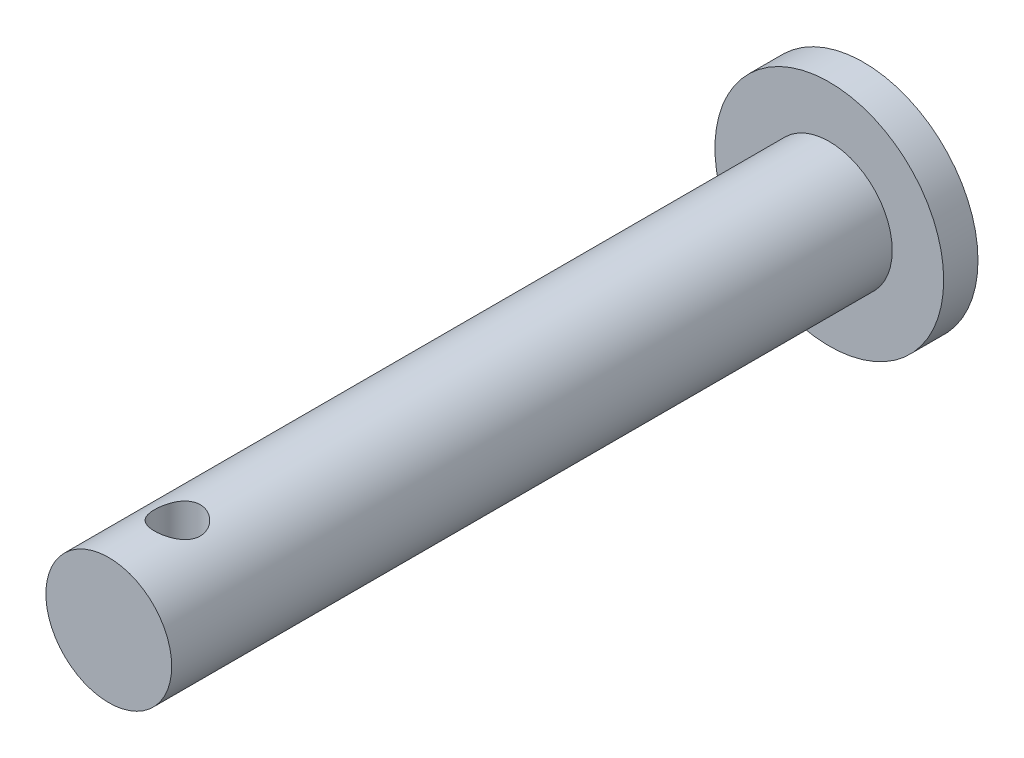
ISO-10303-21;
HEADER;
FILE_DESCRIPTION(('STEP AP214'),'2;1');
FILE_NAME('part.step','',(''),(''),'','','');
FILE_SCHEMA(('AUTOMOTIVE_DESIGN { 1 0 10303 214 1 1 1 1 }'));
ENDSEC;
DATA;
#1=APPLICATION_CONTEXT('core data for automotive mechanical design processes');
#2=APPLICATION_PROTOCOL_DEFINITION('international standard','automotive_design',2000,#1);
#3=PRODUCT_CONTEXT('',#1,'mechanical');
#4=PRODUCT('Part','Part','',(#3));
#5=PRODUCT_RELATED_PRODUCT_CATEGORY('part','',(#4));
#6=PRODUCT_DEFINITION_FORMATION('','',#4);
#7=PRODUCT_DEFINITION_CONTEXT('part definition',#1,'design');
#8=PRODUCT_DEFINITION('design','',#6,#7);
#9=PRODUCT_DEFINITION_SHAPE('','',#8);
#10=(LENGTH_UNIT() NAMED_UNIT(*) SI_UNIT(.MILLI.,.METRE.));
#11=(NAMED_UNIT(*) PLANE_ANGLE_UNIT() SI_UNIT($,.RADIAN.));
#12=(NAMED_UNIT(*) SI_UNIT($,.STERADIAN.) SOLID_ANGLE_UNIT());
#13=UNCERTAINTY_MEASURE_WITH_UNIT(LENGTH_MEASURE(1.E-05),#10,'distance_accuracy_value','');
#14=(GEOMETRIC_REPRESENTATION_CONTEXT(3) GLOBAL_UNCERTAINTY_ASSIGNED_CONTEXT((#13)) GLOBAL_UNIT_ASSIGNED_CONTEXT((#10,
#11,#12)) REPRESENTATION_CONTEXT('',''));
#15=CARTESIAN_POINT('',(0.,0.,0.));
#16=DIRECTION('',(0.,0.,1.));
#17=DIRECTION('',(1.,0.,0.));
#18=AXIS2_PLACEMENT_3D('',#15,#16,#17);
#19=CARTESIAN_POINT('',(0.,0.,33.));
#20=DIRECTION('',(0.,0.,-1.));
#21=DIRECTION('',(-1.,0.,0.));
#22=AXIS2_PLACEMENT_3D('',#19,#20,#21);
#23=CYLINDRICAL_SURFACE('',#22,2.75);
#24=CARTESIAN_POINT('',(0.,0.,1.5));
#25=DIRECTION('',(0.,0.,1.));
#26=DIRECTION('',(1.,0.,0.));
#27=AXIS2_PLACEMENT_3D('',#24,#25,#26);
#28=CIRCLE('',#27,2.75);
#29=CARTESIAN_POINT('',(2.75,0.,1.5));
#30=VERTEX_POINT('',#29);
#31=EDGE_CURVE('E61',#30,#30,#28,.F.);
#32=ORIENTED_EDGE('',*,*,#31,.F.);
#33=EDGE_LOOP('',(#32));
#34=FACE_BOUND('',#33,.T.);
#35=CARTESIAN_POINT('',(0.,0.,33.));
#36=DIRECTION('',(0.,0.,1.));
#37=DIRECTION('',(1.,0.,0.));
#38=AXIS2_PLACEMENT_3D('',#35,#36,#37);
#39=CIRCLE('',#38,2.75);
#40=CARTESIAN_POINT('',(2.75,0.,33.));
#41=VERTEX_POINT('',#40);
#42=EDGE_CURVE('E66',#41,#41,#39,.T.);
#43=ORIENTED_EDGE('',*,*,#42,.F.);
#44=EDGE_LOOP('',(#43));
#45=FACE_BOUND('',#44,.T.);
#46=CARTESIAN_POINT('',(0.,2.75,29.));
#47=CARTESIAN_POINT('',(-0.05427158361245,2.75000102828592,28.999998593537));
#48=CARTESIAN_POINT('',(-0.108533268023079,2.74837919091224,29.0044320973729));
#49=CARTESIAN_POINT('',(-0.21544139666163,2.74207073754075,29.0219822275839));
#50=CARTESIAN_POINT('',(-0.268087964675667,2.73738435703378,29.0350981867679));
#51=CARTESIAN_POINT('',(-0.370208982732222,2.72545162836973,29.0694923559232));
#52=CARTESIAN_POINT('',(-0.419689127060851,2.71821003742993,29.090755404154));
#53=CARTESIAN_POINT('',(-0.514378106430631,2.7018931355003,29.140765474057));
#54=CARTESIAN_POINT('',(-0.559585868286279,2.69281736556791,29.169514369335));
#55=CARTESIAN_POINT('',(-0.64626847495417,2.67336544251623,29.2348919915928));
#56=CARTESIAN_POINT('',(-0.687548063931848,2.66295402798401,29.2717690238565));
#57=CARTESIAN_POINT('',(-0.763491995807494,2.64218336390661,29.3518288743995));
#58=CARTESIAN_POINT('',(-0.798154485530761,2.63182412976351,29.3950134532013));
#59=CARTESIAN_POINT('',(-0.861085204825156,2.61192692799095,29.488327524755));
#60=CARTESIAN_POINT('',(-0.889083899715415,2.60243096933403,29.5386486360943));
#61=CARTESIAN_POINT('',(-0.936134697200381,2.58588061286966,29.6436857380148));
#62=CARTESIAN_POINT('',(-0.955190130970065,2.57882530622898,29.6984000833024));
#63=CARTESIAN_POINT('',(-0.983053381727302,2.56833043749789,29.8084293283742));
#64=CARTESIAN_POINT('',(-0.992232085048729,2.56476051810849,29.8636374678461));
#65=CARTESIAN_POINT('',(-1.00124109076666,2.56125788758604,29.974916877885));
#66=CARTESIAN_POINT('',(-1.00107496394965,2.56132378715702,30.0309878105793));
#67=CARTESIAN_POINT('',(-0.991683838835923,2.56497242531705,30.1390761012675));
#68=CARTESIAN_POINT('',(-0.982964271111847,2.56835894106269,30.1911452026176));
#69=CARTESIAN_POINT('',(-0.957546210263846,2.57794255403146,30.2930232308437));
#70=CARTESIAN_POINT('',(-0.940846587774043,2.58414004906813,30.3428318367135));
#71=CARTESIAN_POINT('',(-0.899650242741095,2.59877143656644,30.4398381812909));
#72=CARTESIAN_POINT('',(-0.875017252502512,2.60724394841139,30.4869719700226));
#73=CARTESIAN_POINT('',(-0.818748232812838,2.62545692968767,30.576587375774));
#74=CARTESIAN_POINT('',(-0.787109890287113,2.63519781748133,30.6190674492575));
#75=CARTESIAN_POINT('',(-0.715383379718291,2.65559784978113,30.7009798547523));
#76=CARTESIAN_POINT('',(-0.674888914115522,2.66627621521456,30.7400524569347));
#77=CARTESIAN_POINT('',(-0.587796439132978,2.6868187492034,30.8109555052473));
#78=CARTESIAN_POINT('',(-0.541197601732014,2.69668280700646,30.8427849672831));
#79=CARTESIAN_POINT('',(-0.442345741239071,2.71466109847137,30.8986635812457));
#80=CARTESIAN_POINT('',(-0.390023720211993,2.72274937801428,30.9225996114695));
#81=CARTESIAN_POINT('',(-0.281728959561495,2.73607360346721,30.9612125713083));
#82=CARTESIAN_POINT('',(-0.225757751375339,2.74131073738571,30.9758933577795));
#83=CARTESIAN_POINT('',(-0.114786083676351,2.74813714481768,30.994903006537));
#84=CARTESIAN_POINT('',(-0.0598790944675641,2.74989711432767,30.9997167322465));
#85=CARTESIAN_POINT('',(0.0499795667814049,2.75009397659377,31.0002587675893));
#86=CARTESIAN_POINT('',(0.104931227273108,2.74853155450921,30.9959889504739));
#87=CARTESIAN_POINT('',(0.211268130365439,2.74237196117977,30.978858296792));
#88=CARTESIAN_POINT('',(0.262710667294036,2.73788504615824,30.9663093876705));
#89=CARTESIAN_POINT('',(0.362728585048041,2.72643794415668,30.9333815719173));
#90=CARTESIAN_POINT('',(0.411303592012264,2.71947743550269,30.9130016468875));
#91=CARTESIAN_POINT('',(0.505765388196055,2.70352785875039,30.8643522216297));
#92=CARTESIAN_POINT('',(0.551535216679312,2.69448636437226,30.8358733251328));
#93=CARTESIAN_POINT('',(0.637795338528293,2.67538261287497,30.7720734500662));
#94=CARTESIAN_POINT('',(0.678283760636928,2.6653199961946,30.7367500573786));
#95=CARTESIAN_POINT('',(0.755135775069413,2.64460590178417,30.6579961059249));
#96=CARTESIAN_POINT('',(0.791154493963307,2.63395220828256,30.6142287209364));
#97=CARTESIAN_POINT('',(0.855397050762111,2.61379664346752,30.5210545082738));
#98=CARTESIAN_POINT('',(0.883620400746443,2.60429484427327,30.4716473278721));
#99=CARTESIAN_POINT('',(0.931445925955383,2.5875770963738,30.368313526383));
#100=CARTESIAN_POINT('',(0.951029808644722,2.58036600678337,30.3143776009791));
#101=CARTESIAN_POINT('',(0.980719773373589,2.56923043824549,30.2036412760543));
#102=CARTESIAN_POINT('',(0.990831247611735,2.56530408958517,30.1468425256363));
#103=CARTESIAN_POINT('',(1.0008235052886,2.56142114085343,30.0357043459204));
#104=CARTESIAN_POINT('',(1.0012878449391,2.56123811777665,29.9814248161302));
#105=CARTESIAN_POINT('',(0.993451162726875,2.56428783487999,29.8736052166234));
#106=CARTESIAN_POINT('',(0.985150873770355,2.56752028945478,29.8200650854568));
#107=CARTESIAN_POINT('',(0.960464129671408,2.57685358798143,29.7167025221326));
#108=CARTESIAN_POINT('',(0.944301768141366,2.58287473014433,29.6668187704012));
#109=CARTESIAN_POINT('',(0.904542113040586,2.59706506711978,29.570438609955));
#110=CARTESIAN_POINT('',(0.880942996186518,2.60523478862223,29.5239430353716));
#111=CARTESIAN_POINT('',(0.8256057397389,2.62331120262658,29.4331292729));
#112=CARTESIAN_POINT('',(0.793519132090325,2.63328440127836,29.3890368019077));
#113=CARTESIAN_POINT('',(0.722670862434718,2.65360200752593,29.3066749241607));
#114=CARTESIAN_POINT('',(0.683907144647625,2.66394652866745,29.268407317648));
#115=CARTESIAN_POINT('',(0.598501849490864,2.68445803074377,29.1968502668555));
#116=CARTESIAN_POINT('',(0.551564727014747,2.69459070625497,29.1639022500985));
#117=CARTESIAN_POINT('',(0.452467923935937,2.7129890144715,29.1063814622141));
#118=CARTESIAN_POINT('',(0.400308357228825,2.72125468788124,29.0818085084876));
#119=CARTESIAN_POINT('',(0.291211408351316,2.73509951863932,29.0415451660636));
#120=CARTESIAN_POINT('',(0.234204430246389,2.74062712951142,29.0260242980112));
#121=CARTESIAN_POINT('',(0.118127131621766,2.74807603940632,29.0052546772001));
#122=CARTESIAN_POINT('',(0.0590577047217948,2.74999888103125,29.0000015304967));
#123=CARTESIAN_POINT('',(0.,2.75,29.));
#124=B_SPLINE_CURVE_WITH_KNOTS('',3,(#46,#47,#48,#49,#50,#51,#52,#53,#54,#55,#56,#57,#58,#59,
#60,#61,#62,#63,#64,#65,#66,#67,#68,#69,#70,#71,#72,#73,#74,#75,#76,#77,#78,#79,#80,#81,#82,#83,
#84,#85,#86,#87,#88,#89,#90,#91,#92,#93,#94,#95,#96,#97,#98,#99,#100,#101,#102,#103,#104,#105,
#106,#107,#108,#109,#110,#111,#112,#113,#114,#115,#116,#117,#118,#119,#120,#121,#122,#123),
.UNSPECIFIED.,.T.,.F.,(4,2,2,2,2,2,2,2,2,2,2,2,2,2,2,2,2,2,2,2,2,2,2,2,2,2,2,2,2,2,2,2,2,2,2,2,
2,2,4),(0.,0.162597052068216,0.32518161104502,0.487465058159471,0.649789161721098,
0.818009820819265,0.986277522644855,1.16049696047027,1.33465145364928,1.50200969548544,
1.66930398789929,1.82727379536548,1.98526596590766,2.14613122186678,2.30704967282306,
2.4780890947483,2.64915174120859,2.8225689630279,2.99591387036392,3.16051402694475,
3.32508024219342,3.48377539851091,3.64249119960605,3.80575629202903,3.96907907474736,
4.14129930414998,4.31353031056168,4.48612425546933,4.65861989091626,4.82064870246278,
4.982663966086,5.14031020509755,5.2979951246446,5.46357833931485,5.6292126259459,
5.80306928554154,5.97692215434631,6.15393413794269,6.3308703548449),.UNSPECIFIED.);
#125=CARTESIAN_POINT('',(0.,2.75,29.));
#126=VERTEX_POINT('',#125);
#127=EDGE_CURVE('E45',#126,#126,#124,.T.);
#128=ORIENTED_EDGE('',*,*,#127,.F.);
#129=EDGE_LOOP('',(#128));
#130=FACE_BOUND('',#129,.T.);
#131=ADVANCED_FACE('F41',(#34,#45,#130),#23,.T.);
#132=CARTESIAN_POINT('',(0.,0.,1.5));
#133=DIRECTION('',(0.,0.,-1.));
#134=DIRECTION('',(-1.,0.,0.));
#135=AXIS2_PLACEMENT_3D('',#132,#133,#134);
#136=CYLINDRICAL_SURFACE('',#135,5.);
#137=CARTESIAN_POINT('',(0.,0.,1.5));
#138=DIRECTION('',(0.,0.,1.));
#139=DIRECTION('',(1.,0.,0.));
#140=AXIS2_PLACEMENT_3D('',#137,#138,#139);
#141=CIRCLE('',#140,5.);
#142=CARTESIAN_POINT('',(5.,0.,1.5));
#143=VERTEX_POINT('',#142);
#144=EDGE_CURVE('E10',#143,#143,#141,.T.);
#145=ORIENTED_EDGE('',*,*,#144,.F.);
#146=EDGE_LOOP('',(#145));
#147=FACE_BOUND('',#146,.T.);
#148=CARTESIAN_POINT('',(0.,0.,0.));
#149=DIRECTION('',(0.,0.,1.));
#150=DIRECTION('',(1.,0.,0.));
#151=AXIS2_PLACEMENT_3D('',#148,#149,#150);
#152=CIRCLE('',#151,5.);
#153=CARTESIAN_POINT('',(5.,0.,0.));
#154=VERTEX_POINT('',#153);
#155=EDGE_CURVE('E55',#154,#154,#152,.T.);
#156=ORIENTED_EDGE('',*,*,#155,.T.);
#157=EDGE_LOOP('',(#156));
#158=FACE_BOUND('',#157,.T.);
#159=ADVANCED_FACE('F43',(#147,#158),#136,.T.);
#160=CARTESIAN_POINT('',(0.,0.,1.5));
#161=DIRECTION('',(0.,0.,1.));
#162=DIRECTION('',(1.,0.,0.));
#163=AXIS2_PLACEMENT_3D('',#160,#161,#162);
#164=PLANE('',#163);
#165=ORIENTED_EDGE('',*,*,#31,.T.);
#166=EDGE_LOOP('',(#165));
#167=FACE_BOUND('',#166,.T.);
#168=ORIENTED_EDGE('',*,*,#144,.T.);
#169=EDGE_LOOP('',(#168));
#170=FACE_BOUND('',#169,.T.);
#171=ADVANCED_FACE('F86',(#167,#170),#164,.T.);
#172=CARTESIAN_POINT('',(0.,0.,0.));
#173=DIRECTION('',(0.,0.,1.));
#174=DIRECTION('',(1.,0.,0.));
#175=AXIS2_PLACEMENT_3D('',#172,#173,#174);
#176=PLANE('',#175);
#177=ORIENTED_EDGE('',*,*,#155,.F.);
#178=EDGE_LOOP('',(#177));
#179=FACE_BOUND('',#178,.T.);
#180=ADVANCED_FACE('F95',(#179),#176,.F.);
#181=CARTESIAN_POINT('',(0.,0.,33.));
#182=DIRECTION('',(0.,0.,1.));
#183=DIRECTION('',(1.,0.,0.));
#184=AXIS2_PLACEMENT_3D('',#181,#182,#183);
#185=PLANE('',#184);
#186=ORIENTED_EDGE('',*,*,#42,.T.);
#187=EDGE_LOOP('',(#186));
#188=FACE_BOUND('',#187,.T.);
#189=ADVANCED_FACE('F93',(#188),#185,.T.);
#190=CARTESIAN_POINT('',(0.,5.,30.));
#191=DIRECTION('',(0.,-1.,0.));
#192=DIRECTION('',(0.,0.,-1.));
#193=AXIS2_PLACEMENT_3D('',#190,#191,#192);
#194=CYLINDRICAL_SURFACE('',#193,1.);
#195=CARTESIAN_POINT('',(0.,0.,30.));
#196=DIRECTION('',(0.,1.,0.));
#197=DIRECTION('',(0.,0.,1.));
#198=AXIS2_PLACEMENT_3D('',#195,#196,#197);
#199=CIRCLE('',#198,1.);
#200=CARTESIAN_POINT('',(0.,0.,31.));
#201=VERTEX_POINT('',#200);
#202=EDGE_CURVE('E70',#201,#201,#199,.T.);
#203=ORIENTED_EDGE('',*,*,#202,.F.);
#204=EDGE_LOOP('',(#203));
#205=FACE_BOUND('',#204,.T.);
#206=ORIENTED_EDGE('',*,*,#127,.T.);
#207=EDGE_LOOP('',(#206));
#208=FACE_BOUND('',#207,.T.);
#209=ADVANCED_FACE('F79',(#205,#208),#194,.F.);
#210=CARTESIAN_POINT('',(0.,0.,30.));
#211=DIRECTION('',(0.,1.,0.));
#212=DIRECTION('',(0.,0.,1.));
#213=AXIS2_PLACEMENT_3D('',#210,#211,#212);
#214=PLANE('',#213);
#215=ORIENTED_EDGE('',*,*,#202,.T.);
#216=EDGE_LOOP('',(#215));
#217=FACE_BOUND('',#216,.T.);
#218=ADVANCED_FACE('F108',(#217),#214,.T.);
#219=CLOSED_SHELL('',(#131,#159,#171,#180,#189,#209,#218));
#220=MANIFOLD_SOLID_BREP('B2',#219);
#221=ADVANCED_BREP_SHAPE_REPRESENTATION('',(#18,#220),#14);
#222=SHAPE_DEFINITION_REPRESENTATION(#9,#221);
ENDSEC;
END-ISO-10303-21;
